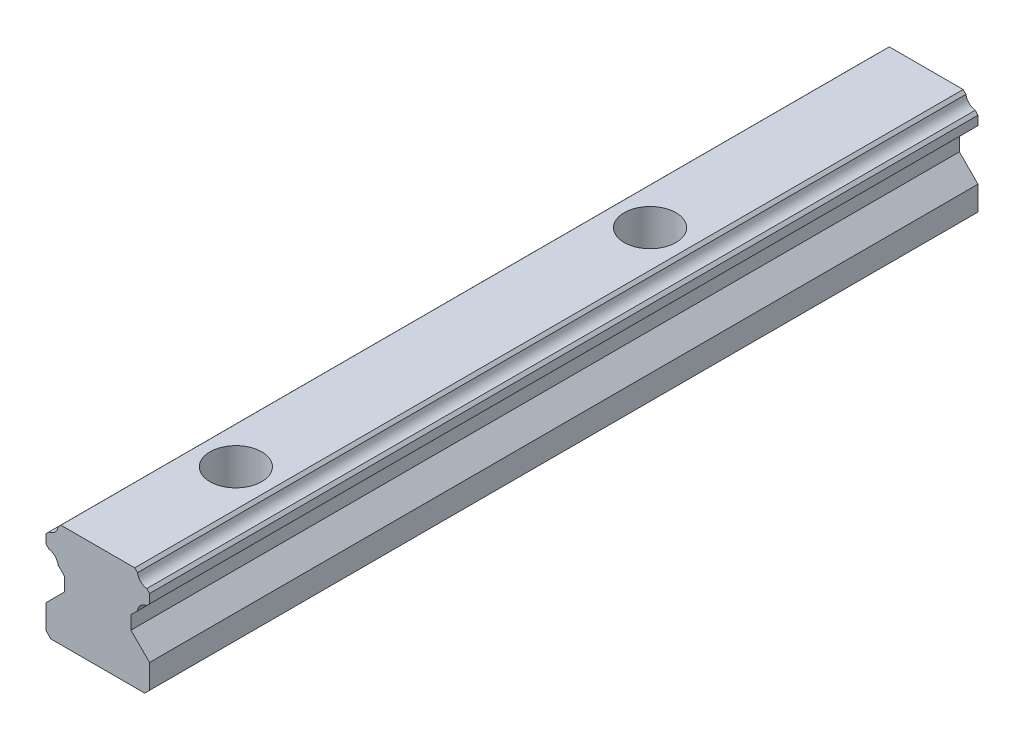
ISO-10303-21;
HEADER;
FILE_DESCRIPTION(('STEP AP214'),'2;1');
FILE_NAME('part.step','',(''),(''),'','','');
FILE_SCHEMA(('AUTOMOTIVE_DESIGN { 1 0 10303 214 1 1 1 1 }'));
ENDSEC;
DATA;
#1=APPLICATION_CONTEXT('core data for automotive mechanical design processes');
#2=APPLICATION_PROTOCOL_DEFINITION('international standard','automotive_design',2000,#1);
#3=PRODUCT_CONTEXT('',#1,'mechanical');
#4=PRODUCT('Part','Part','',(#3));
#5=PRODUCT_RELATED_PRODUCT_CATEGORY('part','',(#4));
#6=PRODUCT_DEFINITION_FORMATION('','',#4);
#7=PRODUCT_DEFINITION_CONTEXT('part definition',#1,'design');
#8=PRODUCT_DEFINITION('design','',#6,#7);
#9=PRODUCT_DEFINITION_SHAPE('','',#8);
#10=(LENGTH_UNIT() NAMED_UNIT(*) SI_UNIT(.MILLI.,.METRE.));
#11=(NAMED_UNIT(*) PLANE_ANGLE_UNIT() SI_UNIT($,.RADIAN.));
#12=(NAMED_UNIT(*) SI_UNIT($,.STERADIAN.) SOLID_ANGLE_UNIT());
#13=UNCERTAINTY_MEASURE_WITH_UNIT(LENGTH_MEASURE(1.E-05),#10,'distance_accuracy_value','');
#14=(GEOMETRIC_REPRESENTATION_CONTEXT(3) GLOBAL_UNCERTAINTY_ASSIGNED_CONTEXT((#13)) GLOBAL_UNIT_ASSIGNED_CONTEXT((#10,
#11,#12)) REPRESENTATION_CONTEXT('',''));
#15=CARTESIAN_POINT('',(0.,0.,0.));
#16=DIRECTION('',(0.,0.,1.));
#17=DIRECTION('',(1.,0.,0.));
#18=AXIS2_PLACEMENT_3D('',#15,#16,#17);
#19=CARTESIAN_POINT('',(5.3500197001096,15.,-120.));
#20=DIRECTION('',(0.,1.,0.));
#21=DIRECTION('',(-1.,0.,0.));
#22=AXIS2_PLACEMENT_3D('',#19,#20,#21);
#23=PLANE('',#22);
#24=CARTESIAN_POINT('',(0.,15.,-20.));
#25=DIRECTION('',(0.,1.,0.));
#26=DIRECTION('',(0.,0.,1.));
#27=AXIS2_PLACEMENT_3D('',#24,#25,#26);
#28=CIRCLE('',#27,3.75000000000001);
#29=CARTESIAN_POINT('',(0.,15.,-16.25));
#30=VERTEX_POINT('',#29);
#31=EDGE_CURVE('E231',#30,#30,#28,.T.);
#32=ORIENTED_EDGE('',*,*,#31,.F.);
#33=EDGE_LOOP('',(#32));
#34=FACE_BOUND('',#33,.T.);
#35=DIRECTION('',(-1.,0.,0.));
#36=VECTOR('',#35,1.);
#37=CARTESIAN_POINT('',(5.3500197001096,15.,0.));
#38=LINE('',#37,#36);
#39=CARTESIAN_POINT('',(5.3500197001096,15.,0.));
#40=VERTEX_POINT('',#39);
#41=CARTESIAN_POINT('',(-5.3500197001096,15.,0.));
#42=VERTEX_POINT('',#41);
#43=EDGE_CURVE('E270',#40,#42,#38,.T.);
#44=ORIENTED_EDGE('',*,*,#43,.F.);
#45=DIRECTION('',(0.,0.,1.));
#46=VECTOR('',#45,1.);
#47=CARTESIAN_POINT('',(5.3500197001096,15.,-120.));
#48=LINE('',#47,#46);
#49=CARTESIAN_POINT('',(5.3500197001096,15.,-120.));
#50=VERTEX_POINT('',#49);
#51=EDGE_CURVE('E312',#50,#40,#48,.T.);
#52=ORIENTED_EDGE('',*,*,#51,.F.);
#53=DIRECTION('',(-1.,0.,0.));
#54=VECTOR('',#53,1.);
#55=CARTESIAN_POINT('',(5.3500197001096,15.,-120.));
#56=LINE('',#55,#54);
#57=CARTESIAN_POINT('',(-5.3500197001096,15.,-120.));
#58=VERTEX_POINT('',#57);
#59=EDGE_CURVE('E508',#50,#58,#56,.T.);
#60=ORIENTED_EDGE('',*,*,#59,.T.);
#61=DIRECTION('',(0.,0.,1.));
#62=VECTOR('',#61,1.);
#63=CARTESIAN_POINT('',(-5.3500197001096,15.,-120.));
#64=LINE('',#63,#62);
#65=EDGE_CURVE('E310',#58,#42,#64,.T.);
#66=ORIENTED_EDGE('',*,*,#65,.T.);
#67=EDGE_LOOP('',(#44,#52,#60,#66));
#68=FACE_BOUND('',#67,.T.);
#69=CARTESIAN_POINT('',(0.,15.,-80.));
#70=DIRECTION('',(0.,1.,0.));
#71=DIRECTION('',(0.,0.,1.));
#72=AXIS2_PLACEMENT_3D('',#69,#70,#71);
#73=CIRCLE('',#72,3.75000000000001);
#74=CARTESIAN_POINT('',(0.,15.,-76.25));
#75=VERTEX_POINT('',#74);
#76=EDGE_CURVE('E455',#75,#75,#73,.T.);
#77=ORIENTED_EDGE('',*,*,#76,.F.);
#78=EDGE_LOOP('',(#77));
#79=FACE_BOUND('',#78,.T.);
#80=ADVANCED_FACE('F33',(#34,#68,#79),#23,.T.);
#81=CARTESIAN_POINT('',(-6.8000072137317,0.,-120.));
#82=DIRECTION('',(0.,-1.,0.));
#83=DIRECTION('',(1.,0.,0.));
#84=AXIS2_PLACEMENT_3D('',#81,#82,#83);
#85=PLANE('',#84);
#86=CARTESIAN_POINT('',(0.,0.,-20.));
#87=DIRECTION('',(0.,1.,0.));
#88=DIRECTION('',(0.,0.,1.));
#89=AXIS2_PLACEMENT_3D('',#86,#87,#88);
#90=CIRCLE('',#89,2.25);
#91=CARTESIAN_POINT('',(0.,0.,-17.75));
#92=VERTEX_POINT('',#91);
#93=EDGE_CURVE('E458',#92,#92,#90,.T.);
#94=ORIENTED_EDGE('',*,*,#93,.T.);
#95=EDGE_LOOP('',(#94));
#96=FACE_BOUND('',#95,.T.);
#97=DIRECTION('',(1.,0.,0.));
#98=VECTOR('',#97,1.);
#99=CARTESIAN_POINT('',(-6.8000072137317,0.,0.));
#100=LINE('',#99,#98);
#101=CARTESIAN_POINT('',(-6.8000072137317,0.,0.));
#102=VERTEX_POINT('',#101);
#103=CARTESIAN_POINT('',(6.8000072137317,0.,0.));
#104=VERTEX_POINT('',#103);
#105=EDGE_CURVE('E234',#102,#104,#100,.T.);
#106=ORIENTED_EDGE('',*,*,#105,.F.);
#107=DIRECTION('',(0.,0.,1.));
#108=VECTOR('',#107,1.);
#109=CARTESIAN_POINT('',(-6.8000072137317,0.,-120.));
#110=LINE('',#109,#108);
#111=CARTESIAN_POINT('',(-6.8000072137317,0.,-120.));
#112=VERTEX_POINT('',#111);
#113=EDGE_CURVE('E335',#112,#102,#110,.T.);
#114=ORIENTED_EDGE('',*,*,#113,.F.);
#115=DIRECTION('',(1.,0.,0.));
#116=VECTOR('',#115,1.);
#117=CARTESIAN_POINT('',(-6.8000072137317,0.,-120.));
#118=LINE('',#117,#116);
#119=CARTESIAN_POINT('',(6.8000072137317,0.,-120.));
#120=VERTEX_POINT('',#119);
#121=EDGE_CURVE('E472',#112,#120,#118,.T.);
#122=ORIENTED_EDGE('',*,*,#121,.T.);
#123=DIRECTION('',(0.,0.,1.));
#124=VECTOR('',#123,1.);
#125=CARTESIAN_POINT('',(6.8000072137317,0.,-120.));
#126=LINE('',#125,#124);
#127=EDGE_CURVE('E334',#120,#104,#126,.T.);
#128=ORIENTED_EDGE('',*,*,#127,.T.);
#129=EDGE_LOOP('',(#106,#114,#122,#128));
#130=FACE_BOUND('',#129,.T.);
#131=CARTESIAN_POINT('',(0.,0.,-80.));
#132=DIRECTION('',(0.,1.,0.));
#133=DIRECTION('',(0.,0.,1.));
#134=AXIS2_PLACEMENT_3D('',#131,#132,#133);
#135=CIRCLE('',#134,2.25);
#136=CARTESIAN_POINT('',(0.,0.,-77.75));
#137=VERTEX_POINT('',#136);
#138=EDGE_CURVE('E447',#137,#137,#135,.T.);
#139=ORIENTED_EDGE('',*,*,#138,.T.);
#140=EDGE_LOOP('',(#139));
#141=FACE_BOUND('',#140,.T.);
#142=ADVANCED_FACE('F348',(#96,#130,#141),#85,.T.);
#143=CARTESIAN_POINT('',(-7.5,4.2000245999998,-120.));
#144=DIRECTION('',(-1.,0.,0.));
#145=DIRECTION('',(0.,0.,1.));
#146=AXIS2_PLACEMENT_3D('',#143,#144,#145);
#147=PLANE('',#146);
#148=DIRECTION('',(0.,-1.,0.));
#149=VECTOR('',#148,1.);
#150=CARTESIAN_POINT('',(-7.5,4.2000245999998,0.));
#151=LINE('',#150,#149);
#152=CARTESIAN_POINT('',(-7.5,4.2000245999998,0.));
#153=VERTEX_POINT('',#152);
#154=CARTESIAN_POINT('',(-7.5,0.699992710002539,0.));
#155=VERTEX_POINT('',#154);
#156=EDGE_CURVE('E227',#153,#155,#151,.T.);
#157=ORIENTED_EDGE('',*,*,#156,.F.);
#158=DIRECTION('',(0.,0.,1.));
#159=VECTOR('',#158,1.);
#160=CARTESIAN_POINT('',(-7.5,4.2000245999998,-120.));
#161=LINE('',#160,#159);
#162=CARTESIAN_POINT('',(-7.5,4.2000245999998,-120.));
#163=VERTEX_POINT('',#162);
#164=EDGE_CURVE('E11',#163,#153,#161,.T.);
#165=ORIENTED_EDGE('',*,*,#164,.F.);
#166=DIRECTION('',(0.,-1.,0.));
#167=VECTOR('',#166,1.);
#168=CARTESIAN_POINT('',(-7.5,4.2000245999998,-120.));
#169=LINE('',#168,#167);
#170=CARTESIAN_POINT('',(-7.5,0.699992710002539,-120.));
#171=VERTEX_POINT('',#170);
#172=EDGE_CURVE('E296',#163,#171,#169,.T.);
#173=ORIENTED_EDGE('',*,*,#172,.T.);
#174=DIRECTION('',(0.,0.,1.));
#175=VECTOR('',#174,1.);
#176=CARTESIAN_POINT('',(-7.5,0.699992710002539,-120.));
#177=LINE('',#176,#175);
#178=EDGE_CURVE('E37',#171,#155,#177,.T.);
#179=ORIENTED_EDGE('',*,*,#178,.T.);
#180=EDGE_LOOP('',(#157,#165,#173,#179));
#181=FACE_BOUND('',#180,.T.);
#182=ADVANCED_FACE('F35',(#181),#147,.T.);
#183=CARTESIAN_POINT('',(-4.8000182999995,6.9000063000003,-120.));
#184=DIRECTION('',(-0.707106781186547,0.707106781186547,0.));
#185=DIRECTION('',(-0.707106781186548,-0.707106781186548,0.));
#186=AXIS2_PLACEMENT_3D('',#183,#184,#185);
#187=PLANE('',#186);
#188=DIRECTION('',(-0.707106781186548,-0.707106781186548,0.));
#189=VECTOR('',#188,1.);
#190=CARTESIAN_POINT('',(-4.8000182999995,6.9000063000003,0.));
#191=LINE('',#190,#189);
#192=CARTESIAN_POINT('',(-4.8000182999995,6.9000063000003,0.));
#193=VERTEX_POINT('',#192);
#194=EDGE_CURVE('E294',#193,#153,#191,.T.);
#195=ORIENTED_EDGE('',*,*,#194,.F.);
#196=DIRECTION('',(0.,0.,1.));
#197=VECTOR('',#196,1.);
#198=CARTESIAN_POINT('',(-4.8000182999995,6.9000063000003,-120.));
#199=LINE('',#198,#197);
#200=CARTESIAN_POINT('',(-4.8000182999995,6.9000063000003,-120.));
#201=VERTEX_POINT('',#200);
#202=EDGE_CURVE('E43',#201,#193,#199,.T.);
#203=ORIENTED_EDGE('',*,*,#202,.F.);
#204=DIRECTION('',(-0.707106781186548,-0.707106781186548,0.));
#205=VECTOR('',#204,1.);
#206=CARTESIAN_POINT('',(-4.8000182999995,6.9000063000003,-120.));
#207=LINE('',#206,#205);
#208=EDGE_CURVE('E217',#201,#163,#207,.T.);
#209=ORIENTED_EDGE('',*,*,#208,.T.);
#210=ORIENTED_EDGE('',*,*,#164,.T.);
#211=EDGE_LOOP('',(#195,#203,#209,#210));
#212=FACE_BOUND('',#211,.T.);
#213=ADVANCED_FACE('F340',(#212),#187,.T.);
#214=CARTESIAN_POINT('',(-4.8000182999995,8.8400053999999,-120.));
#215=DIRECTION('',(-1.,0.,0.));
#216=DIRECTION('',(0.,0.,1.));
#217=AXIS2_PLACEMENT_3D('',#214,#215,#216);
#218=PLANE('',#217);
#219=DIRECTION('',(0.,-1.,0.));
#220=VECTOR('',#219,1.);
#221=CARTESIAN_POINT('',(-4.8000182999995,8.8400053999999,0.));
#222=LINE('',#221,#220);
#223=CARTESIAN_POINT('',(-4.8000182999995,8.8400053999999,0.));
#224=VERTEX_POINT('',#223);
#225=EDGE_CURVE('E204',#224,#193,#222,.T.);
#226=ORIENTED_EDGE('',*,*,#225,.F.);
#227=DIRECTION('',(0.,0.,1.));
#228=VECTOR('',#227,1.);
#229=CARTESIAN_POINT('',(-4.8000182999995,8.8400053999999,-120.));
#230=LINE('',#229,#228);
#231=CARTESIAN_POINT('',(-4.8000182999995,8.8400053999999,-120.));
#232=VERTEX_POINT('',#231);
#233=EDGE_CURVE('E199',#232,#224,#230,.T.);
#234=ORIENTED_EDGE('',*,*,#233,.F.);
#235=DIRECTION('',(0.,-1.,0.));
#236=VECTOR('',#235,1.);
#237=CARTESIAN_POINT('',(-4.8000182999995,8.8400053999999,-120.));
#238=LINE('',#237,#236);
#239=EDGE_CURVE('E202',#232,#201,#238,.T.);
#240=ORIENTED_EDGE('',*,*,#239,.T.);
#241=ORIENTED_EDGE('',*,*,#202,.T.);
#242=EDGE_LOOP('',(#226,#234,#240,#241));
#243=FACE_BOUND('',#242,.T.);
#244=ADVANCED_FACE('F201',(#243),#218,.T.);
#245=CARTESIAN_POINT('',(-5.7559468125191,9.794179117755,-120.));
#246=DIRECTION('',(-0.706456870044271,-0.707756095535215,0.));
#247=DIRECTION('',(0.707756095535215,-0.706456870044271,0.));
#248=AXIS2_PLACEMENT_3D('',#245,#246,#247);
#249=PLANE('',#248);
#250=DIRECTION('',(0.707756095535215,-0.706456870044271,0.));
#251=VECTOR('',#250,1.);
#252=CARTESIAN_POINT('',(-5.7559468125191,9.794179117755,0.));
#253=LINE('',#252,#251);
#254=CARTESIAN_POINT('',(-5.7559468125191,9.794179117755,0.));
#255=VERTEX_POINT('',#254);
#256=EDGE_CURVE('E291',#255,#224,#253,.T.);
#257=ORIENTED_EDGE('',*,*,#256,.F.);
#258=DIRECTION('',(0.,0.,1.));
#259=VECTOR('',#258,1.);
#260=CARTESIAN_POINT('',(-5.7559468125191,9.794179117755,-120.));
#261=LINE('',#260,#259);
#262=CARTESIAN_POINT('',(-5.7559468125191,9.794179117755,-120.));
#263=VERTEX_POINT('',#262);
#264=EDGE_CURVE('E209',#263,#255,#261,.T.);
#265=ORIENTED_EDGE('',*,*,#264,.F.);
#266=DIRECTION('',(0.707756095535215,-0.706456870044271,0.));
#267=VECTOR('',#266,1.);
#268=CARTESIAN_POINT('',(-5.7559468125191,9.794179117755,-120.));
#269=LINE('',#268,#267);
#270=EDGE_CURVE('E215',#263,#232,#269,.T.);
#271=ORIENTED_EDGE('',*,*,#270,.T.);
#272=ORIENTED_EDGE('',*,*,#233,.T.);
#273=EDGE_LOOP('',(#257,#265,#271,#272));
#274=FACE_BOUND('',#273,.T.);
#275=ADVANCED_FACE('F219',(#274),#249,.T.);
#276=CARTESIAN_POINT('',(-7.30229328109914,9.58823668135776,-120.));
#277=DIRECTION('',(0.,0.,1.));
#278=DIRECTION('',(1.,0.,0.));
#279=AXIS2_PLACEMENT_3D('',#276,#277,#278);
#280=CYLINDRICAL_SURFACE('',#279,1.55999989999974);
#281=CARTESIAN_POINT('',(-7.30229328109914,9.58823668135776,0.));
#282=DIRECTION('',(0.,0.,-1.));
#283=DIRECTION('',(-1.,0.,0.));
#284=AXIS2_PLACEMENT_3D('',#281,#282,#283);
#285=CIRCLE('',#284,1.55999989999974);
#286=CARTESIAN_POINT('',(-7.0943256899454,11.134312089942,0.));
#287=VERTEX_POINT('',#286);
#288=EDGE_CURVE('E288',#287,#255,#285,.T.);
#289=ORIENTED_EDGE('',*,*,#288,.F.);
#290=DIRECTION('',(0.,0.,1.));
#291=VECTOR('',#290,1.);
#292=CARTESIAN_POINT('',(-7.0943256899454,11.134312089942,-120.));
#293=LINE('',#292,#291);
#294=CARTESIAN_POINT('',(-7.0943256899454,11.134312089942,-120.));
#295=VERTEX_POINT('',#294);
#296=EDGE_CURVE('E300',#295,#287,#293,.T.);
#297=ORIENTED_EDGE('',*,*,#296,.F.);
#298=CARTESIAN_POINT('',(-7.30229328109914,9.58823668135776,-120.));
#299=DIRECTION('',(0.,0.,-1.));
#300=DIRECTION('',(-1.,0.,0.));
#301=AXIS2_PLACEMENT_3D('',#298,#299,#300);
#302=CIRCLE('',#301,1.55999989999974);
#303=EDGE_CURVE('E220',#295,#263,#302,.T.);
#304=ORIENTED_EDGE('',*,*,#303,.T.);
#305=ORIENTED_EDGE('',*,*,#264,.T.);
#306=EDGE_LOOP('',(#289,#297,#304,#305));
#307=FACE_BOUND('',#306,.T.);
#308=ADVANCED_FACE('F571',(#307),#280,.F.);
#309=CARTESIAN_POINT('',(-7.5,11.539986599989,-120.));
#310=DIRECTION('',(-0.707106955483918,-0.707106606889134,0.));
#311=DIRECTION('',(0.707106606889134,-0.707106955483918,0.));
#312=AXIS2_PLACEMENT_3D('',#309,#310,#311);
#313=PLANE('',#312);
#314=DIRECTION('',(0.707106606889134,-0.707106955483918,0.));
#315=VECTOR('',#314,1.);
#316=CARTESIAN_POINT('',(-7.5,11.539986599989,0.));
#317=LINE('',#316,#315);
#318=CARTESIAN_POINT('',(-7.5,11.539986599989,0.));
#319=VERTEX_POINT('',#318);
#320=EDGE_CURVE('E285',#319,#287,#317,.T.);
#321=ORIENTED_EDGE('',*,*,#320,.F.);
#322=DIRECTION('',(0.,0.,1.));
#323=VECTOR('',#322,1.);
#324=CARTESIAN_POINT('',(-7.5,11.539986599989,-120.));
#325=LINE('',#324,#323);
#326=CARTESIAN_POINT('',(-7.5,11.539986599989,-120.));
#327=VERTEX_POINT('',#326);
#328=EDGE_CURVE('E302',#327,#319,#325,.T.);
#329=ORIENTED_EDGE('',*,*,#328,.F.);
#330=DIRECTION('',(0.707106606889134,-0.707106955483918,0.));
#331=VECTOR('',#330,1.);
#332=CARTESIAN_POINT('',(-7.5,11.539986599989,-120.));
#333=LINE('',#332,#331);
#334=EDGE_CURVE('E222',#327,#295,#333,.T.);
#335=ORIENTED_EDGE('',*,*,#334,.T.);
#336=ORIENTED_EDGE('',*,*,#296,.T.);
#337=EDGE_LOOP('',(#321,#329,#335,#336));
#338=FACE_BOUND('',#337,.T.);
#339=ADVANCED_FACE('F526',(#338),#313,.T.);
#340=CARTESIAN_POINT('',(-7.5,12.850020399955,-120.));
#341=DIRECTION('',(-1.,0.,0.));
#342=DIRECTION('',(0.,0.,1.));
#343=AXIS2_PLACEMENT_3D('',#340,#341,#342);
#344=PLANE('',#343);
#345=DIRECTION('',(0.,-1.,0.));
#346=VECTOR('',#345,1.);
#347=CARTESIAN_POINT('',(-7.5,12.850020399955,0.));
#348=LINE('',#347,#346);
#349=CARTESIAN_POINT('',(-7.5,12.850020399955,0.));
#350=VERTEX_POINT('',#349);
#351=EDGE_CURVE('E282',#350,#319,#348,.T.);
#352=ORIENTED_EDGE('',*,*,#351,.F.);
#353=DIRECTION('',(0.,0.,1.));
#354=VECTOR('',#353,1.);
#355=CARTESIAN_POINT('',(-7.5,12.850020399955,-120.));
#356=LINE('',#355,#354);
#357=CARTESIAN_POINT('',(-7.5,12.850020399955,-120.));
#358=VERTEX_POINT('',#357);
#359=EDGE_CURVE('E304',#358,#350,#356,.T.);
#360=ORIENTED_EDGE('',*,*,#359,.F.);
#361=DIRECTION('',(0.,-1.,0.));
#362=VECTOR('',#361,1.);
#363=CARTESIAN_POINT('',(-7.5,12.850020399955,-120.));
#364=LINE('',#363,#362);
#365=EDGE_CURVE('E520',#358,#327,#364,.T.);
#366=ORIENTED_EDGE('',*,*,#365,.T.);
#367=ORIENTED_EDGE('',*,*,#328,.T.);
#368=EDGE_LOOP('',(#352,#360,#366,#367));
#369=FACE_BOUND('',#368,.T.);
#370=ADVANCED_FACE('F532',(#369),#344,.T.);
#371=CARTESIAN_POINT('',(-7.0943256899454,13.268442750921,-120.));
#372=DIRECTION('',(-0.717959196634107,0.696085190166051,0.));
#373=DIRECTION('',(-0.696085190166051,-0.717959196634107,0.));
#374=AXIS2_PLACEMENT_3D('',#371,#372,#373);
#375=PLANE('',#374);
#376=DIRECTION('',(-0.696085190166051,-0.717959196634107,0.));
#377=VECTOR('',#376,1.);
#378=CARTESIAN_POINT('',(-7.0943256899454,13.268442750921,0.));
#379=LINE('',#378,#377);
#380=CARTESIAN_POINT('',(-7.0943256899454,13.268442750921,0.));
#381=VERTEX_POINT('',#380);
#382=EDGE_CURVE('E279',#381,#350,#379,.T.);
#383=ORIENTED_EDGE('',*,*,#382,.F.);
#384=DIRECTION('',(0.,0.,1.));
#385=VECTOR('',#384,1.);
#386=CARTESIAN_POINT('',(-7.0943256899454,13.268442750921,-120.));
#387=LINE('',#386,#385);
#388=CARTESIAN_POINT('',(-7.0943256899454,13.268442750921,-120.));
#389=VERTEX_POINT('',#388);
#390=EDGE_CURVE('E306',#389,#381,#387,.T.);
#391=ORIENTED_EDGE('',*,*,#390,.F.);
#392=DIRECTION('',(-0.696085190166051,-0.717959196634107,0.));
#393=VECTOR('',#392,1.);
#394=CARTESIAN_POINT('',(-7.0943256899454,13.268442750921,-120.));
#395=LINE('',#394,#393);
#396=EDGE_CURVE('E517',#389,#358,#395,.T.);
#397=ORIENTED_EDGE('',*,*,#396,.T.);
#398=ORIENTED_EDGE('',*,*,#359,.T.);
#399=EDGE_LOOP('',(#383,#391,#397,#398));
#400=FACE_BOUND('',#399,.T.);
#401=ADVANCED_FACE('F535',(#400),#375,.T.);
#402=CARTESIAN_POINT('',(-7.30025219070474,14.8147913417259,-120.));
#403=DIRECTION('',(0.,0.,1.));
#404=DIRECTION('',(1.,0.,0.));
#405=AXIS2_PLACEMENT_3D('',#402,#403,#404);
#406=CYLINDRICAL_SURFACE('',#405,1.55999989999974);
#407=CARTESIAN_POINT('',(-7.30025219070474,14.8147913417259,0.));
#408=DIRECTION('',(0.,0.,-1.));
#409=DIRECTION('',(-1.,0.,0.));
#410=AXIS2_PLACEMENT_3D('',#407,#408,#409);
#411=CIRCLE('',#410,1.55999989999974);
#412=CARTESIAN_POINT('',(-5.7559468125191,14.594063937659,0.));
#413=VERTEX_POINT('',#412);
#414=EDGE_CURVE('E276',#413,#381,#411,.T.);
#415=ORIENTED_EDGE('',*,*,#414,.F.);
#416=DIRECTION('',(0.,0.,1.));
#417=VECTOR('',#416,1.);
#418=CARTESIAN_POINT('',(-5.7559468125191,14.594063937659,-120.));
#419=LINE('',#418,#417);
#420=CARTESIAN_POINT('',(-5.7559468125191,14.594063937659,-120.));
#421=VERTEX_POINT('',#420);
#422=EDGE_CURVE('E308',#421,#413,#419,.T.);
#423=ORIENTED_EDGE('',*,*,#422,.F.);
#424=CARTESIAN_POINT('',(-7.30025219070474,14.8147913417259,-120.));
#425=DIRECTION('',(0.,0.,-1.));
#426=DIRECTION('',(-1.,0.,0.));
#427=AXIS2_PLACEMENT_3D('',#424,#425,#426);
#428=CIRCLE('',#427,1.55999989999974);
#429=EDGE_CURVE('E514',#421,#389,#428,.T.);
#430=ORIENTED_EDGE('',*,*,#429,.T.);
#431=ORIENTED_EDGE('',*,*,#390,.T.);
#432=EDGE_LOOP('',(#415,#423,#430,#431));
#433=FACE_BOUND('',#432,.T.);
#434=ADVANCED_FACE('F540',(#433),#406,.F.);
#435=CARTESIAN_POINT('',(-5.3500197001096,15.,-120.));
#436=DIRECTION('',(-0.70711457624681,0.707098986040352,0.));
#437=DIRECTION('',(-0.707098986040352,-0.70711457624681,0.));
#438=AXIS2_PLACEMENT_3D('',#435,#436,#437);
#439=PLANE('',#438);
#440=DIRECTION('',(-0.707098986040352,-0.70711457624681,0.));
#441=VECTOR('',#440,1.);
#442=CARTESIAN_POINT('',(-5.3500197001096,15.,0.));
#443=LINE('',#442,#441);
#444=EDGE_CURVE('E273',#42,#413,#443,.T.);
#445=ORIENTED_EDGE('',*,*,#444,.F.);
#446=ORIENTED_EDGE('',*,*,#65,.F.);
#447=DIRECTION('',(-0.707098986040352,-0.70711457624681,0.));
#448=VECTOR('',#447,1.);
#449=CARTESIAN_POINT('',(-5.3500197001096,15.,-120.));
#450=LINE('',#449,#448);
#451=EDGE_CURVE('E511',#58,#421,#450,.T.);
#452=ORIENTED_EDGE('',*,*,#451,.T.);
#453=ORIENTED_EDGE('',*,*,#422,.T.);
#454=EDGE_LOOP('',(#445,#446,#452,#453));
#455=FACE_BOUND('',#454,.T.);
#456=ADVANCED_FACE('F362',(#455),#439,.T.);
#457=CARTESIAN_POINT('',(5.3500197001096,15.,-120.));
#458=DIRECTION('',(0.707114576246815,0.707098986040348,0.));
#459=DIRECTION('',(-0.707098986040348,0.707114576246815,0.));
#460=AXIS2_PLACEMENT_3D('',#457,#458,#459);
#461=PLANE('',#460);
#462=DIRECTION('',(-0.707098986040348,0.707114576246815,0.));
#463=VECTOR('',#462,1.);
#464=CARTESIAN_POINT('',(5.3500197001096,15.,0.));
#465=LINE('',#464,#463);
#466=CARTESIAN_POINT('',(5.75594681251909,14.594063937659,0.));
#467=VERTEX_POINT('',#466);
#468=EDGE_CURVE('E267',#467,#40,#465,.T.);
#469=ORIENTED_EDGE('',*,*,#468,.F.);
#470=DIRECTION('',(0.,0.,1.));
#471=VECTOR('',#470,1.);
#472=CARTESIAN_POINT('',(5.75594681251909,14.594063937659,-120.));
#473=LINE('',#472,#471);
#474=CARTESIAN_POINT('',(5.75594681251909,14.594063937659,-120.));
#475=VERTEX_POINT('',#474);
#476=EDGE_CURVE('E314',#475,#467,#473,.T.);
#477=ORIENTED_EDGE('',*,*,#476,.F.);
#478=DIRECTION('',(-0.707098986040348,0.707114576246815,0.));
#479=VECTOR('',#478,1.);
#480=CARTESIAN_POINT('',(5.3500197001096,15.,-120.));
#481=LINE('',#480,#479);
#482=EDGE_CURVE('E505',#475,#50,#481,.T.);
#483=ORIENTED_EDGE('',*,*,#482,.T.);
#484=ORIENTED_EDGE('',*,*,#51,.T.);
#485=EDGE_LOOP('',(#469,#477,#483,#484));
#486=FACE_BOUND('',#485,.T.);
#487=ADVANCED_FACE('F364',(#486),#461,.T.);
#488=CARTESIAN_POINT('',(7.30025219070473,14.8147913417259,-120.));
#489=DIRECTION('',(0.,0.,1.));
#490=DIRECTION('',(1.,0.,0.));
#491=AXIS2_PLACEMENT_3D('',#488,#489,#490);
#492=CYLINDRICAL_SURFACE('',#491,1.55999989999974);
#493=CARTESIAN_POINT('',(7.30025219070473,14.8147913417259,0.));
#494=DIRECTION('',(0.,0.,-1.));
#495=DIRECTION('',(1.,0.,0.));
#496=AXIS2_PLACEMENT_3D('',#493,#494,#495);
#497=CIRCLE('',#496,1.55999989999974);
#498=CARTESIAN_POINT('',(7.09432568994539,13.268442750921,0.));
#499=VERTEX_POINT('',#498);
#500=EDGE_CURVE('E264',#499,#467,#497,.T.);
#501=ORIENTED_EDGE('',*,*,#500,.F.);
#502=DIRECTION('',(0.,0.,1.));
#503=VECTOR('',#502,1.);
#504=CARTESIAN_POINT('',(7.09432568994539,13.268442750921,-120.));
#505=LINE('',#504,#503);
#506=CARTESIAN_POINT('',(7.09432568994539,13.268442750921,-120.));
#507=VERTEX_POINT('',#506);
#508=EDGE_CURVE('E316',#507,#499,#505,.T.);
#509=ORIENTED_EDGE('',*,*,#508,.F.);
#510=CARTESIAN_POINT('',(7.30025219070473,14.8147913417259,-120.));
#511=DIRECTION('',(0.,0.,-1.));
#512=DIRECTION('',(1.,0.,0.));
#513=AXIS2_PLACEMENT_3D('',#510,#511,#512);
#514=CIRCLE('',#513,1.55999989999974);
#515=EDGE_CURVE('E502',#507,#475,#514,.T.);
#516=ORIENTED_EDGE('',*,*,#515,.T.);
#517=ORIENTED_EDGE('',*,*,#476,.T.);
#518=EDGE_LOOP('',(#501,#509,#516,#517));
#519=FACE_BOUND('',#518,.T.);
#520=ADVANCED_FACE('F367',(#519),#492,.F.);
#521=CARTESIAN_POINT('',(7.09432568994539,13.268442750921,-120.));
#522=DIRECTION('',(0.717959196634104,0.696085190166054,0.));
#523=DIRECTION('',(-0.696085190166054,0.717959196634104,0.));
#524=AXIS2_PLACEMENT_3D('',#521,#522,#523);
#525=PLANE('',#524);
#526=DIRECTION('',(-0.696085190166054,0.717959196634104,0.));
#527=VECTOR('',#526,1.);
#528=CARTESIAN_POINT('',(7.09432568994539,13.268442750921,0.));
#529=LINE('',#528,#527);
#530=CARTESIAN_POINT('',(7.5,12.850020399955,0.));
#531=VERTEX_POINT('',#530);
#532=EDGE_CURVE('E261',#531,#499,#529,.T.);
#533=ORIENTED_EDGE('',*,*,#532,.F.);
#534=DIRECTION('',(0.,0.,1.));
#535=VECTOR('',#534,1.);
#536=CARTESIAN_POINT('',(7.5,12.850020399955,-120.));
#537=LINE('',#536,#535);
#538=CARTESIAN_POINT('',(7.5,12.850020399955,-120.));
#539=VERTEX_POINT('',#538);
#540=EDGE_CURVE('E318',#539,#531,#537,.T.);
#541=ORIENTED_EDGE('',*,*,#540,.F.);
#542=DIRECTION('',(-0.696085190166054,0.717959196634104,0.));
#543=VECTOR('',#542,1.);
#544=CARTESIAN_POINT('',(7.09432568994539,13.268442750921,-120.));
#545=LINE('',#544,#543);
#546=EDGE_CURVE('E499',#539,#507,#545,.T.);
#547=ORIENTED_EDGE('',*,*,#546,.T.);
#548=ORIENTED_EDGE('',*,*,#508,.T.);
#549=EDGE_LOOP('',(#533,#541,#547,#548));
#550=FACE_BOUND('',#549,.T.);
#551=ADVANCED_FACE('F371',(#550),#525,.T.);
#552=CARTESIAN_POINT('',(7.5,12.850020399955,-120.));
#553=DIRECTION('',(1.,0.,0.));
#554=DIRECTION('',(0.,0.,-1.));
#555=AXIS2_PLACEMENT_3D('',#552,#553,#554);
#556=PLANE('',#555);
#557=DIRECTION('',(0.,1.,0.));
#558=VECTOR('',#557,1.);
#559=CARTESIAN_POINT('',(7.5,12.850020399955,0.));
#560=LINE('',#559,#558);
#561=CARTESIAN_POINT('',(7.5,11.539986599989,0.));
#562=VERTEX_POINT('',#561);
#563=EDGE_CURVE('E258',#562,#531,#560,.T.);
#564=ORIENTED_EDGE('',*,*,#563,.F.);
#565=DIRECTION('',(0.,0.,1.));
#566=VECTOR('',#565,1.);
#567=CARTESIAN_POINT('',(7.5,11.539986599989,-120.));
#568=LINE('',#567,#566);
#569=CARTESIAN_POINT('',(7.5,11.539986599989,-120.));
#570=VERTEX_POINT('',#569);
#571=EDGE_CURVE('E320',#570,#562,#568,.T.);
#572=ORIENTED_EDGE('',*,*,#571,.F.);
#573=DIRECTION('',(0.,1.,0.));
#574=VECTOR('',#573,1.);
#575=CARTESIAN_POINT('',(7.5,12.850020399955,-120.));
#576=LINE('',#575,#574);
#577=EDGE_CURVE('E496',#570,#539,#576,.T.);
#578=ORIENTED_EDGE('',*,*,#577,.T.);
#579=ORIENTED_EDGE('',*,*,#540,.T.);
#580=EDGE_LOOP('',(#564,#572,#578,#579));
#581=FACE_BOUND('',#580,.T.);
#582=ADVANCED_FACE('F375',(#581),#556,.T.);
#583=CARTESIAN_POINT('',(7.5,11.539986599989,-120.));
#584=DIRECTION('',(0.707106955483915,-0.707106606889138,0.));
#585=DIRECTION('',(0.707106606889138,0.707106955483915,0.));
#586=AXIS2_PLACEMENT_3D('',#583,#584,#585);
#587=PLANE('',#586);
#588=DIRECTION('',(0.707106606889138,0.707106955483915,0.));
#589=VECTOR('',#588,1.);
#590=CARTESIAN_POINT('',(7.5,11.539986599989,0.));
#591=LINE('',#590,#589);
#592=CARTESIAN_POINT('',(7.09432568994539,11.134312089942,0.));
#593=VERTEX_POINT('',#592);
#594=EDGE_CURVE('E255',#593,#562,#591,.T.);
#595=ORIENTED_EDGE('',*,*,#594,.F.);
#596=DIRECTION('',(0.,0.,1.));
#597=VECTOR('',#596,1.);
#598=CARTESIAN_POINT('',(7.09432568994539,11.134312089942,-120.));
#599=LINE('',#598,#597);
#600=CARTESIAN_POINT('',(7.09432568994539,11.134312089942,-120.));
#601=VERTEX_POINT('',#600);
#602=EDGE_CURVE('E322',#601,#593,#599,.T.);
#603=ORIENTED_EDGE('',*,*,#602,.F.);
#604=DIRECTION('',(0.707106606889138,0.707106955483915,0.));
#605=VECTOR('',#604,1.);
#606=CARTESIAN_POINT('',(7.5,11.539986599989,-120.));
#607=LINE('',#606,#605);
#608=EDGE_CURVE('E493',#601,#570,#607,.T.);
#609=ORIENTED_EDGE('',*,*,#608,.T.);
#610=ORIENTED_EDGE('',*,*,#571,.T.);
#611=EDGE_LOOP('',(#595,#603,#609,#610));
#612=FACE_BOUND('',#611,.T.);
#613=ADVANCED_FACE('F379',(#612),#587,.T.);
#614=CARTESIAN_POINT('',(7.30229328109913,9.58823668135777,-120.));
#615=DIRECTION('',(0.,0.,1.));
#616=DIRECTION('',(1.,0.,0.));
#617=AXIS2_PLACEMENT_3D('',#614,#615,#616);
#618=CYLINDRICAL_SURFACE('',#617,1.55999989999974);
#619=CARTESIAN_POINT('',(7.30229328109913,9.58823668135777,0.));
#620=DIRECTION('',(0.,0.,-1.));
#621=DIRECTION('',(1.,0.,0.));
#622=AXIS2_PLACEMENT_3D('',#619,#620,#621);
#623=CIRCLE('',#622,1.55999989999974);
#624=CARTESIAN_POINT('',(5.7559468125191,9.794179117755,0.));
#625=VERTEX_POINT('',#624);
#626=EDGE_CURVE('E252',#625,#593,#623,.T.);
#627=ORIENTED_EDGE('',*,*,#626,.F.);
#628=DIRECTION('',(0.,0.,1.));
#629=VECTOR('',#628,1.);
#630=CARTESIAN_POINT('',(5.7559468125191,9.794179117755,-120.));
#631=LINE('',#630,#629);
#632=CARTESIAN_POINT('',(5.7559468125191,9.794179117755,-120.));
#633=VERTEX_POINT('',#632);
#634=EDGE_CURVE('E324',#633,#625,#631,.T.);
#635=ORIENTED_EDGE('',*,*,#634,.F.);
#636=CARTESIAN_POINT('',(7.30229328109913,9.58823668135777,-120.));
#637=DIRECTION('',(0.,0.,-1.));
#638=DIRECTION('',(1.,0.,0.));
#639=AXIS2_PLACEMENT_3D('',#636,#637,#638);
#640=CIRCLE('',#639,1.55999989999974);
#641=EDGE_CURVE('E490',#633,#601,#640,.T.);
#642=ORIENTED_EDGE('',*,*,#641,.T.);
#643=ORIENTED_EDGE('',*,*,#602,.T.);
#644=EDGE_LOOP('',(#627,#635,#642,#643));
#645=FACE_BOUND('',#644,.T.);
#646=ADVANCED_FACE('F383',(#645),#618,.F.);
#647=CARTESIAN_POINT('',(5.7559468125191,9.794179117755,-120.));
#648=DIRECTION('',(0.706456870044271,-0.707756095535214,0.));
#649=DIRECTION('',(0.707756095535214,0.706456870044271,0.));
#650=AXIS2_PLACEMENT_3D('',#647,#648,#649);
#651=PLANE('',#650);
#652=DIRECTION('',(0.707756095535214,0.706456870044271,0.));
#653=VECTOR('',#652,1.);
#654=CARTESIAN_POINT('',(5.7559468125191,9.794179117755,0.));
#655=LINE('',#654,#653);
#656=CARTESIAN_POINT('',(4.8000182999995,8.8400053999999,0.));
#657=VERTEX_POINT('',#656);
#658=EDGE_CURVE('E249',#657,#625,#655,.T.);
#659=ORIENTED_EDGE('',*,*,#658,.F.);
#660=DIRECTION('',(0.,0.,1.));
#661=VECTOR('',#660,1.);
#662=CARTESIAN_POINT('',(4.8000182999995,8.8400053999999,-120.));
#663=LINE('',#662,#661);
#664=CARTESIAN_POINT('',(4.8000182999995,8.8400053999999,-120.));
#665=VERTEX_POINT('',#664);
#666=EDGE_CURVE('E326',#665,#657,#663,.T.);
#667=ORIENTED_EDGE('',*,*,#666,.F.);
#668=DIRECTION('',(0.707756095535214,0.706456870044271,0.));
#669=VECTOR('',#668,1.);
#670=CARTESIAN_POINT('',(5.7559468125191,9.794179117755,-120.));
#671=LINE('',#670,#669);
#672=EDGE_CURVE('E487',#665,#633,#671,.T.);
#673=ORIENTED_EDGE('',*,*,#672,.T.);
#674=ORIENTED_EDGE('',*,*,#634,.T.);
#675=EDGE_LOOP('',(#659,#667,#673,#674));
#676=FACE_BOUND('',#675,.T.);
#677=ADVANCED_FACE('F387',(#676),#651,.T.);
#678=CARTESIAN_POINT('',(4.8000182999995,8.8400053999999,-120.));
#679=DIRECTION('',(1.,0.,0.));
#680=DIRECTION('',(0.,0.,-1.));
#681=AXIS2_PLACEMENT_3D('',#678,#679,#680);
#682=PLANE('',#681);
#683=DIRECTION('',(0.,1.,0.));
#684=VECTOR('',#683,1.);
#685=CARTESIAN_POINT('',(4.8000182999995,8.8400053999999,0.));
#686=LINE('',#685,#684);
#687=CARTESIAN_POINT('',(4.8000182999995,6.9000063000003,0.));
#688=VERTEX_POINT('',#687);
#689=EDGE_CURVE('E246',#688,#657,#686,.T.);
#690=ORIENTED_EDGE('',*,*,#689,.F.);
#691=DIRECTION('',(0.,0.,1.));
#692=VECTOR('',#691,1.);
#693=CARTESIAN_POINT('',(4.8000182999995,6.9000063000003,-120.));
#694=LINE('',#693,#692);
#695=CARTESIAN_POINT('',(4.8000182999995,6.9000063000003,-120.));
#696=VERTEX_POINT('',#695);
#697=EDGE_CURVE('E328',#696,#688,#694,.T.);
#698=ORIENTED_EDGE('',*,*,#697,.F.);
#699=DIRECTION('',(0.,1.,0.));
#700=VECTOR('',#699,1.);
#701=CARTESIAN_POINT('',(4.8000182999995,8.8400053999999,-120.));
#702=LINE('',#701,#700);
#703=EDGE_CURVE('E484',#696,#665,#702,.T.);
#704=ORIENTED_EDGE('',*,*,#703,.T.);
#705=ORIENTED_EDGE('',*,*,#666,.T.);
#706=EDGE_LOOP('',(#690,#698,#704,#705));
#707=FACE_BOUND('',#706,.T.);
#708=ADVANCED_FACE('F391',(#707),#682,.T.);
#709=CARTESIAN_POINT('',(4.8000182999995,6.9000063000003,-120.));
#710=DIRECTION('',(0.707106781186547,0.707106781186547,0.));
#711=DIRECTION('',(-0.707106781186548,0.707106781186548,0.));
#712=AXIS2_PLACEMENT_3D('',#709,#710,#711);
#713=PLANE('',#712);
#714=DIRECTION('',(-0.707106781186548,0.707106781186548,0.));
#715=VECTOR('',#714,1.);
#716=CARTESIAN_POINT('',(4.8000182999995,6.9000063000003,0.));
#717=LINE('',#716,#715);
#718=CARTESIAN_POINT('',(7.5,4.2000245999998,0.));
#719=VERTEX_POINT('',#718);
#720=EDGE_CURVE('E243',#719,#688,#717,.T.);
#721=ORIENTED_EDGE('',*,*,#720,.F.);
#722=DIRECTION('',(0.,0.,1.));
#723=VECTOR('',#722,1.);
#724=CARTESIAN_POINT('',(7.5,4.2000245999998,-120.));
#725=LINE('',#724,#723);
#726=CARTESIAN_POINT('',(7.5,4.2000245999998,-120.));
#727=VERTEX_POINT('',#726);
#728=EDGE_CURVE('E330',#727,#719,#725,.T.);
#729=ORIENTED_EDGE('',*,*,#728,.F.);
#730=DIRECTION('',(-0.707106781186548,0.707106781186548,0.));
#731=VECTOR('',#730,1.);
#732=CARTESIAN_POINT('',(4.8000182999995,6.9000063000003,-120.));
#733=LINE('',#732,#731);
#734=EDGE_CURVE('E481',#727,#696,#733,.T.);
#735=ORIENTED_EDGE('',*,*,#734,.T.);
#736=ORIENTED_EDGE('',*,*,#697,.T.);
#737=EDGE_LOOP('',(#721,#729,#735,#736));
#738=FACE_BOUND('',#737,.T.);
#739=ADVANCED_FACE('F395',(#738),#713,.T.);
#740=CARTESIAN_POINT('',(7.5,4.2000245999998,-120.));
#741=DIRECTION('',(1.,0.,0.));
#742=DIRECTION('',(0.,1.,0.));
#743=AXIS2_PLACEMENT_3D('',#740,#741,#742);
#744=PLANE('',#743);
#745=DIRECTION('',(0.,1.,0.));
#746=VECTOR('',#745,1.);
#747=CARTESIAN_POINT('',(7.5,4.2000245999998,0.));
#748=LINE('',#747,#746);
#749=CARTESIAN_POINT('',(7.5,0.699992710002543,0.));
#750=VERTEX_POINT('',#749);
#751=EDGE_CURVE('E240',#750,#719,#748,.T.);
#752=ORIENTED_EDGE('',*,*,#751,.F.);
#753=DIRECTION('',(0.,0.,1.));
#754=VECTOR('',#753,1.);
#755=CARTESIAN_POINT('',(7.5,0.699992710002543,-120.));
#756=LINE('',#755,#754);
#757=CARTESIAN_POINT('',(7.5,0.699992710002543,-120.));
#758=VERTEX_POINT('',#757);
#759=EDGE_CURVE('E332',#758,#750,#756,.T.);
#760=ORIENTED_EDGE('',*,*,#759,.F.);
#761=DIRECTION('',(0.,1.,0.));
#762=VECTOR('',#761,1.);
#763=CARTESIAN_POINT('',(7.5,4.2000245999998,-120.));
#764=LINE('',#763,#762);
#765=EDGE_CURVE('E478',#758,#727,#764,.T.);
#766=ORIENTED_EDGE('',*,*,#765,.T.);
#767=ORIENTED_EDGE('',*,*,#728,.T.);
#768=EDGE_LOOP('',(#752,#760,#766,#767));
#769=FACE_BOUND('',#768,.T.);
#770=ADVANCED_FACE('F399',(#769),#744,.T.);
#771=CARTESIAN_POINT('',(7.5,0.699992710002543,-120.));
#772=DIRECTION('',(0.707106742666124,-0.707106819706969,0.));
#773=DIRECTION('',(0.707106819706969,0.707106742666124,0.));
#774=AXIS2_PLACEMENT_3D('',#771,#772,#773);
#775=PLANE('',#774);
#776=DIRECTION('',(0.707106819706969,0.707106742666124,0.));
#777=VECTOR('',#776,1.);
#778=CARTESIAN_POINT('',(7.5,0.699992710002543,0.));
#779=LINE('',#778,#777);
#780=EDGE_CURVE('E237',#104,#750,#779,.T.);
#781=ORIENTED_EDGE('',*,*,#780,.F.);
#782=ORIENTED_EDGE('',*,*,#127,.F.);
#783=DIRECTION('',(0.707106819706969,0.707106742666124,0.));
#784=VECTOR('',#783,1.);
#785=CARTESIAN_POINT('',(7.5,0.699992710002543,-120.));
#786=LINE('',#785,#784);
#787=EDGE_CURVE('E475',#120,#758,#786,.T.);
#788=ORIENTED_EDGE('',*,*,#787,.T.);
#789=ORIENTED_EDGE('',*,*,#759,.T.);
#790=EDGE_LOOP('',(#781,#782,#788,#789));
#791=FACE_BOUND('',#790,.T.);
#792=ADVANCED_FACE('F403',(#791),#775,.T.);
#793=CARTESIAN_POINT('',(-7.5,0.699992710002539,-120.));
#794=DIRECTION('',(-0.707106742666121,-0.707106819706972,0.));
#795=DIRECTION('',(0.707106819706972,-0.707106742666121,0.));
#796=AXIS2_PLACEMENT_3D('',#793,#794,#795);
#797=PLANE('',#796);
#798=DIRECTION('',(0.707106819706972,-0.707106742666121,0.));
#799=VECTOR('',#798,1.);
#800=CARTESIAN_POINT('',(-7.5,0.699992710002539,0.));
#801=LINE('',#800,#799);
#802=EDGE_CURVE('E230',#155,#102,#801,.T.);
#803=ORIENTED_EDGE('',*,*,#802,.F.);
#804=ORIENTED_EDGE('',*,*,#178,.F.);
#805=DIRECTION('',(0.707106819706972,-0.707106742666121,0.));
#806=VECTOR('',#805,1.);
#807=CARTESIAN_POINT('',(-7.5,0.699992710002539,-120.));
#808=LINE('',#807,#806);
#809=EDGE_CURVE('E470',#171,#112,#808,.T.);
#810=ORIENTED_EDGE('',*,*,#809,.T.);
#811=ORIENTED_EDGE('',*,*,#113,.T.);
#812=EDGE_LOOP('',(#803,#804,#810,#811));
#813=FACE_BOUND('',#812,.T.);
#814=ADVANCED_FACE('F337',(#813),#797,.T.);
#815=CARTESIAN_POINT('',(7.30229328109913,9.58823668135777,-120.));
#816=DIRECTION('',(0.,0.,1.));
#817=DIRECTION('',(1.,0.,0.));
#818=AXIS2_PLACEMENT_3D('',#815,#816,#817);
#819=PLANE('',#818);
#820=ORIENTED_EDGE('',*,*,#172,.F.);
#821=ORIENTED_EDGE('',*,*,#208,.F.);
#822=ORIENTED_EDGE('',*,*,#239,.F.);
#823=ORIENTED_EDGE('',*,*,#270,.F.);
#824=ORIENTED_EDGE('',*,*,#303,.F.);
#825=ORIENTED_EDGE('',*,*,#334,.F.);
#826=ORIENTED_EDGE('',*,*,#365,.F.);
#827=ORIENTED_EDGE('',*,*,#396,.F.);
#828=ORIENTED_EDGE('',*,*,#429,.F.);
#829=ORIENTED_EDGE('',*,*,#451,.F.);
#830=ORIENTED_EDGE('',*,*,#59,.F.);
#831=ORIENTED_EDGE('',*,*,#482,.F.);
#832=ORIENTED_EDGE('',*,*,#515,.F.);
#833=ORIENTED_EDGE('',*,*,#546,.F.);
#834=ORIENTED_EDGE('',*,*,#577,.F.);
#835=ORIENTED_EDGE('',*,*,#608,.F.);
#836=ORIENTED_EDGE('',*,*,#641,.F.);
#837=ORIENTED_EDGE('',*,*,#672,.F.);
#838=ORIENTED_EDGE('',*,*,#703,.F.);
#839=ORIENTED_EDGE('',*,*,#734,.F.);
#840=ORIENTED_EDGE('',*,*,#765,.F.);
#841=ORIENTED_EDGE('',*,*,#787,.F.);
#842=ORIENTED_EDGE('',*,*,#121,.F.);
#843=ORIENTED_EDGE('',*,*,#809,.F.);
#844=EDGE_LOOP('',(#820,#821,#822,#823,#824,#825,#826,#827,#828,#829,#830,#831,#832,#833,#834,
#835,#836,#837,#838,#839,#840,#841,#842,#843));
#845=FACE_BOUND('',#844,.T.);
#846=ADVANCED_FACE('F213',(#845),#819,.F.);
#847=CARTESIAN_POINT('',(7.30229328109913,9.58823668135777,0.));
#848=DIRECTION('',(0.,0.,1.));
#849=DIRECTION('',(1.,0.,0.));
#850=AXIS2_PLACEMENT_3D('',#847,#848,#849);
#851=PLANE('',#850);
#852=ORIENTED_EDGE('',*,*,#156,.T.);
#853=ORIENTED_EDGE('',*,*,#802,.T.);
#854=ORIENTED_EDGE('',*,*,#105,.T.);
#855=ORIENTED_EDGE('',*,*,#780,.T.);
#856=ORIENTED_EDGE('',*,*,#751,.T.);
#857=ORIENTED_EDGE('',*,*,#720,.T.);
#858=ORIENTED_EDGE('',*,*,#689,.T.);
#859=ORIENTED_EDGE('',*,*,#658,.T.);
#860=ORIENTED_EDGE('',*,*,#626,.T.);
#861=ORIENTED_EDGE('',*,*,#594,.T.);
#862=ORIENTED_EDGE('',*,*,#563,.T.);
#863=ORIENTED_EDGE('',*,*,#532,.T.);
#864=ORIENTED_EDGE('',*,*,#500,.T.);
#865=ORIENTED_EDGE('',*,*,#468,.T.);
#866=ORIENTED_EDGE('',*,*,#43,.T.);
#867=ORIENTED_EDGE('',*,*,#444,.T.);
#868=ORIENTED_EDGE('',*,*,#414,.T.);
#869=ORIENTED_EDGE('',*,*,#382,.T.);
#870=ORIENTED_EDGE('',*,*,#351,.T.);
#871=ORIENTED_EDGE('',*,*,#320,.T.);
#872=ORIENTED_EDGE('',*,*,#288,.T.);
#873=ORIENTED_EDGE('',*,*,#256,.T.);
#874=ORIENTED_EDGE('',*,*,#225,.T.);
#875=ORIENTED_EDGE('',*,*,#194,.T.);
#876=EDGE_LOOP('',(#852,#853,#854,#855,#856,#857,#858,#859,#860,#861,#862,#863,#864,#865,#866,
#867,#868,#869,#870,#871,#872,#873,#874,#875));
#877=FACE_BOUND('',#876,.T.);
#878=ADVANCED_FACE('F339',(#877),#851,.T.);
#879=CARTESIAN_POINT('',(0.,0.,-20.));
#880=DIRECTION('',(0.,1.,0.));
#881=DIRECTION('',(0.,0.,1.));
#882=AXIS2_PLACEMENT_3D('',#879,#880,#881);
#883=CYLINDRICAL_SURFACE('',#882,3.75000000000001);
#884=ORIENTED_EDGE('',*,*,#31,.T.);
#885=EDGE_LOOP('',(#884));
#886=FACE_BOUND('',#885,.T.);
#887=CARTESIAN_POINT('',(0.,9.7,-20.));
#888=DIRECTION('',(0.,1.,0.));
#889=DIRECTION('',(0.,0.,1.));
#890=AXIS2_PLACEMENT_3D('',#887,#888,#889);
#891=CIRCLE('',#890,3.75);
#892=CARTESIAN_POINT('',(0.,9.7,-16.25));
#893=VERTEX_POINT('',#892);
#894=EDGE_CURVE('E464',#893,#893,#891,.T.);
#895=ORIENTED_EDGE('',*,*,#894,.F.);
#896=EDGE_LOOP('',(#895));
#897=FACE_BOUND('',#896,.T.);
#898=ADVANCED_FACE('F415',(#886,#897),#883,.F.);
#899=CARTESIAN_POINT('',(0.,9.7,-23.75));
#900=DIRECTION('',(0.,1.,0.));
#901=DIRECTION('',(0.,0.,1.));
#902=AXIS2_PLACEMENT_3D('',#899,#900,#901);
#903=PLANE('',#902);
#904=ORIENTED_EDGE('',*,*,#894,.T.);
#905=EDGE_LOOP('',(#904));
#906=FACE_BOUND('',#905,.T.);
#907=CARTESIAN_POINT('',(0.,9.7,-20.));
#908=DIRECTION('',(0.,1.,0.));
#909=DIRECTION('',(0.,0.,1.));
#910=AXIS2_PLACEMENT_3D('',#907,#908,#909);
#911=CIRCLE('',#910,2.25000000000001);
#912=CARTESIAN_POINT('',(0.,9.7,-17.75));
#913=VERTEX_POINT('',#912);
#914=EDGE_CURVE('E461',#913,#913,#911,.T.);
#915=ORIENTED_EDGE('',*,*,#914,.F.);
#916=EDGE_LOOP('',(#915));
#917=FACE_BOUND('',#916,.T.);
#918=ADVANCED_FACE('F419',(#906,#917),#903,.T.);
#919=CARTESIAN_POINT('',(0.,0.,-20.));
#920=DIRECTION('',(0.,1.,0.));
#921=DIRECTION('',(0.,0.,1.));
#922=AXIS2_PLACEMENT_3D('',#919,#920,#921);
#923=CYLINDRICAL_SURFACE('',#922,2.25);
#924=ORIENTED_EDGE('',*,*,#914,.T.);
#925=EDGE_LOOP('',(#924));
#926=FACE_BOUND('',#925,.T.);
#927=ORIENTED_EDGE('',*,*,#93,.F.);
#928=EDGE_LOOP('',(#927));
#929=FACE_BOUND('',#928,.T.);
#930=ADVANCED_FACE('F423',(#926,#929),#923,.F.);
#931=CARTESIAN_POINT('',(0.,0.,-80.));
#932=DIRECTION('',(0.,1.,0.));
#933=DIRECTION('',(0.,0.,1.));
#934=AXIS2_PLACEMENT_3D('',#931,#932,#933);
#935=CYLINDRICAL_SURFACE('',#934,3.75000000000001);
#936=ORIENTED_EDGE('',*,*,#76,.T.);
#937=EDGE_LOOP('',(#936));
#938=FACE_BOUND('',#937,.T.);
#939=CARTESIAN_POINT('',(0.,9.7,-80.));
#940=DIRECTION('',(0.,1.,0.));
#941=DIRECTION('',(0.,0.,1.));
#942=AXIS2_PLACEMENT_3D('',#939,#940,#941);
#943=CIRCLE('',#942,3.75);
#944=CARTESIAN_POINT('',(0.,9.7,-76.25));
#945=VERTEX_POINT('',#944);
#946=EDGE_CURVE('E450',#945,#945,#943,.T.);
#947=ORIENTED_EDGE('',*,*,#946,.F.);
#948=EDGE_LOOP('',(#947));
#949=FACE_BOUND('',#948,.T.);
#950=ADVANCED_FACE('F427',(#938,#949),#935,.F.);
#951=CARTESIAN_POINT('',(0.,9.7,-83.75));
#952=DIRECTION('',(0.,1.,0.));
#953=DIRECTION('',(0.,0.,1.));
#954=AXIS2_PLACEMENT_3D('',#951,#952,#953);
#955=PLANE('',#954);
#956=ORIENTED_EDGE('',*,*,#946,.T.);
#957=EDGE_LOOP('',(#956));
#958=FACE_BOUND('',#957,.T.);
#959=CARTESIAN_POINT('',(0.,9.7,-80.));
#960=DIRECTION('',(0.,1.,0.));
#961=DIRECTION('',(0.,0.,1.));
#962=AXIS2_PLACEMENT_3D('',#959,#960,#961);
#963=CIRCLE('',#962,2.25000000000001);
#964=CARTESIAN_POINT('',(0.,9.7,-77.75));
#965=VERTEX_POINT('',#964);
#966=EDGE_CURVE('E444',#965,#965,#963,.T.);
#967=ORIENTED_EDGE('',*,*,#966,.F.);
#968=EDGE_LOOP('',(#967));
#969=FACE_BOUND('',#968,.T.);
#970=ADVANCED_FACE('F431',(#958,#969),#955,.T.);
#971=CARTESIAN_POINT('',(0.,0.,-80.));
#972=DIRECTION('',(0.,1.,0.));
#973=DIRECTION('',(0.,0.,1.));
#974=AXIS2_PLACEMENT_3D('',#971,#972,#973);
#975=CYLINDRICAL_SURFACE('',#974,2.25);
#976=ORIENTED_EDGE('',*,*,#966,.T.);
#977=EDGE_LOOP('',(#976));
#978=FACE_BOUND('',#977,.T.);
#979=ORIENTED_EDGE('',*,*,#138,.F.);
#980=EDGE_LOOP('',(#979));
#981=FACE_BOUND('',#980,.T.);
#982=ADVANCED_FACE('F435',(#978,#981),#975,.F.);
#983=CLOSED_SHELL('',(#80,#142,#182,#213,#244,#275,#308,#339,#370,#401,#434,#456,#487,#520,#551,
#582,#613,#646,#677,#708,#739,#770,#792,#814,#846,#878,#898,#918,#930,#950,#970,#982));
#984=MANIFOLD_SOLID_BREP('B2',#983);
#985=ADVANCED_BREP_SHAPE_REPRESENTATION('',(#18,#984),#14);
#986=SHAPE_DEFINITION_REPRESENTATION(#9,#985);
ENDSEC;
END-ISO-10303-21;
